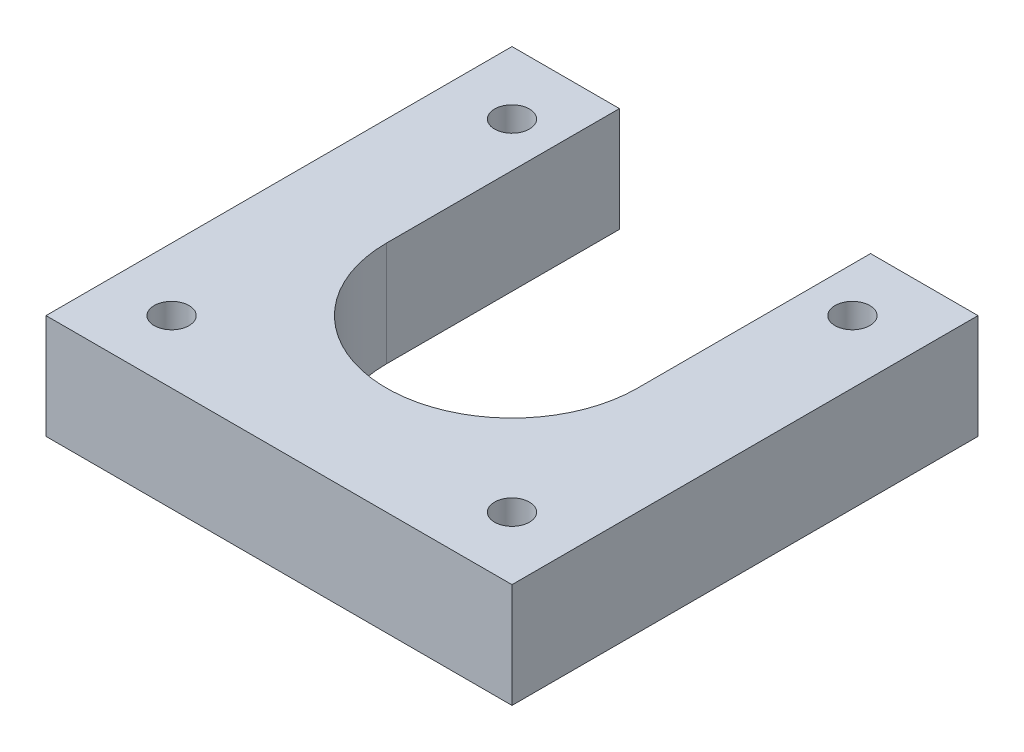
ISO-10303-21;
HEADER;
FILE_DESCRIPTION(('STEP AP214'),'2;1');
FILE_NAME('part.step','',(''),(''),'','','');
FILE_SCHEMA(('AUTOMOTIVE_DESIGN { 1 0 10303 214 1 1 1 1 }'));
ENDSEC;
DATA;
#1=APPLICATION_CONTEXT('core data for automotive mechanical design processes');
#2=APPLICATION_PROTOCOL_DEFINITION('international standard','automotive_design',2000,#1);
#3=PRODUCT_CONTEXT('',#1,'mechanical');
#4=PRODUCT('Part','Part','',(#3));
#5=PRODUCT_RELATED_PRODUCT_CATEGORY('part','',(#4));
#6=PRODUCT_DEFINITION_FORMATION('','',#4);
#7=PRODUCT_DEFINITION_CONTEXT('part definition',#1,'design');
#8=PRODUCT_DEFINITION('design','',#6,#7);
#9=PRODUCT_DEFINITION_SHAPE('','',#8);
#10=(LENGTH_UNIT() NAMED_UNIT(*) SI_UNIT(.MILLI.,.METRE.));
#11=(NAMED_UNIT(*) PLANE_ANGLE_UNIT() SI_UNIT($,.RADIAN.));
#12=(NAMED_UNIT(*) SI_UNIT($,.STERADIAN.) SOLID_ANGLE_UNIT());
#13=UNCERTAINTY_MEASURE_WITH_UNIT(LENGTH_MEASURE(1.E-05),#10,'distance_accuracy_value','');
#14=(GEOMETRIC_REPRESENTATION_CONTEXT(3) GLOBAL_UNCERTAINTY_ASSIGNED_CONTEXT((#13)) GLOBAL_UNIT_ASSIGNED_CONTEXT((#10,
#11,#12)) REPRESENTATION_CONTEXT('',''));
#15=CARTESIAN_POINT('',(0.,0.,0.));
#16=DIRECTION('',(0.,0.,1.));
#17=DIRECTION('',(1.,0.,0.));
#18=AXIS2_PLACEMENT_3D('',#15,#16,#17);
#19=CARTESIAN_POINT('',(21.209,9.525,-21.209));
#20=DIRECTION('',(0.,1.,0.));
#21=DIRECTION('',(0.,0.,1.));
#22=AXIS2_PLACEMENT_3D('',#19,#20,#21);
#23=PLANE('',#22);
#24=CARTESIAN_POINT('',(36.703,9.525,-5.715));
#25=DIRECTION('',(0.,1.,0.));
#26=DIRECTION('',(0.,0.,1.));
#27=AXIS2_PLACEMENT_3D('',#24,#25,#26);
#28=CIRCLE('',#27,1.5875);
#29=CARTESIAN_POINT('',(36.703,9.525,-4.1275));
#30=VERTEX_POINT('',#29);
#31=EDGE_CURVE('E188',#30,#30,#28,.T.);
#32=ORIENTED_EDGE('',*,*,#31,.F.);
#33=EDGE_LOOP('',(#32));
#34=FACE_BOUND('',#33,.T.);
#35=CARTESIAN_POINT('',(5.715,9.525,-36.703));
#36=DIRECTION('',(0.,1.,0.));
#37=DIRECTION('',(0.,0.,1.));
#38=AXIS2_PLACEMENT_3D('',#35,#36,#37);
#39=CIRCLE('',#38,1.5875);
#40=CARTESIAN_POINT('',(5.715,9.525,-35.1155));
#41=VERTEX_POINT('',#40);
#42=EDGE_CURVE('E134',#41,#41,#39,.T.);
#43=ORIENTED_EDGE('',*,*,#42,.F.);
#44=EDGE_LOOP('',(#43));
#45=FACE_BOUND('',#44,.T.);
#46=DIRECTION('',(0.,0.,1.));
#47=VECTOR('',#46,1.);
#48=CARTESIAN_POINT('',(0.,9.525,0.));
#49=LINE('',#48,#47);
#50=CARTESIAN_POINT('',(0.,9.525,-42.418));
#51=VERTEX_POINT('',#50);
#52=CARTESIAN_POINT('',(0.,9.525,0.));
#53=VERTEX_POINT('',#52);
#54=EDGE_CURVE('E145',#51,#53,#49,.T.);
#55=ORIENTED_EDGE('',*,*,#54,.T.);
#56=DIRECTION('',(1.,0.,0.));
#57=VECTOR('',#56,1.);
#58=CARTESIAN_POINT('',(0.,9.525,0.));
#59=LINE('',#58,#57);
#60=CARTESIAN_POINT('',(42.418,9.525,0.));
#61=VERTEX_POINT('',#60);
#62=EDGE_CURVE('E93',#53,#61,#59,.T.);
#63=ORIENTED_EDGE('',*,*,#62,.T.);
#64=DIRECTION('',(0.,0.,-1.));
#65=VECTOR('',#64,1.);
#66=CARTESIAN_POINT('',(42.418,9.525,0.));
#67=LINE('',#66,#65);
#68=CARTESIAN_POINT('',(42.418,9.525,-42.418));
#69=VERTEX_POINT('',#68);
#70=EDGE_CURVE('E160',#61,#69,#67,.T.);
#71=ORIENTED_EDGE('',*,*,#70,.T.);
#72=DIRECTION('',(-1.,0.,0.));
#73=VECTOR('',#72,1.);
#74=CARTESIAN_POINT('',(32.639,9.525,-42.418));
#75=LINE('',#74,#73);
#76=CARTESIAN_POINT('',(32.639,9.525,-42.418));
#77=VERTEX_POINT('',#76);
#78=EDGE_CURVE('E173',#69,#77,#75,.T.);
#79=ORIENTED_EDGE('',*,*,#78,.T.);
#80=DIRECTION('',(0.,0.,1.));
#81=VECTOR('',#80,1.);
#82=CARTESIAN_POINT('',(32.639,9.525,-21.209));
#83=LINE('',#82,#81);
#84=CARTESIAN_POINT('',(32.639,9.525,-21.209));
#85=VERTEX_POINT('',#84);
#86=EDGE_CURVE('E112',#77,#85,#83,.T.);
#87=ORIENTED_EDGE('',*,*,#86,.T.);
#88=CARTESIAN_POINT('',(21.209,9.525,-21.209));
#89=DIRECTION('',(0.,-1.,0.));
#90=DIRECTION('',(0.,0.,1.));
#91=AXIS2_PLACEMENT_3D('',#88,#89,#90);
#92=CIRCLE('',#91,11.43);
#93=CARTESIAN_POINT('',(9.779,9.525,-21.209));
#94=VERTEX_POINT('',#93);
#95=EDGE_CURVE('E106',#85,#94,#92,.T.);
#96=ORIENTED_EDGE('',*,*,#95,.T.);
#97=DIRECTION('',(0.,0.,-1.));
#98=VECTOR('',#97,1.);
#99=CARTESIAN_POINT('',(9.779,9.525,-21.209));
#100=LINE('',#99,#98);
#101=CARTESIAN_POINT('',(9.779,9.525,-42.418));
#102=VERTEX_POINT('',#101);
#103=EDGE_CURVE('E110',#94,#102,#100,.T.);
#104=ORIENTED_EDGE('',*,*,#103,.T.);
#105=DIRECTION('',(-1.,0.,0.));
#106=VECTOR('',#105,1.);
#107=CARTESIAN_POINT('',(9.779,9.525,-42.418));
#108=LINE('',#107,#106);
#109=EDGE_CURVE('E50',#102,#51,#108,.T.);
#110=ORIENTED_EDGE('',*,*,#109,.T.);
#111=EDGE_LOOP('',(#55,#63,#71,#79,#87,#96,#104,#110));
#112=FACE_BOUND('',#111,.T.);
#113=CARTESIAN_POINT('',(36.703,9.525,-36.703));
#114=DIRECTION('',(0.,1.,0.));
#115=DIRECTION('',(0.,0.,1.));
#116=AXIS2_PLACEMENT_3D('',#113,#114,#115);
#117=CIRCLE('',#116,1.5875);
#118=CARTESIAN_POINT('',(36.703,9.525,-35.1155));
#119=VERTEX_POINT('',#118);
#120=EDGE_CURVE('E182',#119,#119,#117,.T.);
#121=ORIENTED_EDGE('',*,*,#120,.F.);
#122=EDGE_LOOP('',(#121));
#123=FACE_BOUND('',#122,.T.);
#124=CARTESIAN_POINT('',(5.715,9.525,-5.715));
#125=DIRECTION('',(0.,1.,0.));
#126=DIRECTION('',(0.,0.,1.));
#127=AXIS2_PLACEMENT_3D('',#124,#125,#126);
#128=CIRCLE('',#127,1.5875);
#129=CARTESIAN_POINT('',(5.715,9.525,-4.1275));
#130=VERTEX_POINT('',#129);
#131=EDGE_CURVE('E194',#130,#130,#128,.T.);
#132=ORIENTED_EDGE('',*,*,#131,.F.);
#133=EDGE_LOOP('',(#132));
#134=FACE_BOUND('',#133,.T.);
#135=ADVANCED_FACE('F33',(#34,#45,#112,#123,#134),#23,.T.);
#136=CARTESIAN_POINT('',(21.209,0.,-21.209));
#137=DIRECTION('',(0.,1.,0.));
#138=DIRECTION('',(0.,0.,1.));
#139=AXIS2_PLACEMENT_3D('',#136,#137,#138);
#140=PLANE('',#139);
#141=DIRECTION('',(0.,0.,1.));
#142=VECTOR('',#141,1.);
#143=CARTESIAN_POINT('',(0.,0.,0.));
#144=LINE('',#143,#142);
#145=CARTESIAN_POINT('',(0.,0.,-42.418));
#146=VERTEX_POINT('',#145);
#147=CARTESIAN_POINT('',(0.,0.,0.));
#148=VERTEX_POINT('',#147);
#149=EDGE_CURVE('E130',#146,#148,#144,.T.);
#150=ORIENTED_EDGE('',*,*,#149,.F.);
#151=DIRECTION('',(-1.,0.,0.));
#152=VECTOR('',#151,1.);
#153=CARTESIAN_POINT('',(9.779,0.,-42.418));
#154=LINE('',#153,#152);
#155=CARTESIAN_POINT('',(9.779,0.,-42.418));
#156=VERTEX_POINT('',#155);
#157=EDGE_CURVE('E85',#156,#146,#154,.T.);
#158=ORIENTED_EDGE('',*,*,#157,.F.);
#159=DIRECTION('',(0.,0.,-1.));
#160=VECTOR('',#159,1.);
#161=CARTESIAN_POINT('',(9.779,0.,-21.209));
#162=LINE('',#161,#160);
#163=CARTESIAN_POINT('',(9.779,0.,-21.209));
#164=VERTEX_POINT('',#163);
#165=EDGE_CURVE('E79',#164,#156,#162,.T.);
#166=ORIENTED_EDGE('',*,*,#165,.F.);
#167=CARTESIAN_POINT('',(21.209,0.,-21.209));
#168=DIRECTION('',(0.,-1.,0.));
#169=DIRECTION('',(0.,0.,1.));
#170=AXIS2_PLACEMENT_3D('',#167,#168,#169);
#171=CIRCLE('',#170,11.43);
#172=CARTESIAN_POINT('',(32.639,0.,-21.209));
#173=VERTEX_POINT('',#172);
#174=EDGE_CURVE('E120',#173,#164,#171,.T.);
#175=ORIENTED_EDGE('',*,*,#174,.F.);
#176=DIRECTION('',(0.,0.,1.));
#177=VECTOR('',#176,1.);
#178=CARTESIAN_POINT('',(32.639,0.,-21.209));
#179=LINE('',#178,#177);
#180=CARTESIAN_POINT('',(32.639,0.,-42.418));
#181=VERTEX_POINT('',#180);
#182=EDGE_CURVE('E140',#181,#173,#179,.T.);
#183=ORIENTED_EDGE('',*,*,#182,.F.);
#184=DIRECTION('',(-1.,0.,0.));
#185=VECTOR('',#184,1.);
#186=CARTESIAN_POINT('',(32.639,0.,-42.418));
#187=LINE('',#186,#185);
#188=CARTESIAN_POINT('',(42.418,0.,-42.418));
#189=VERTEX_POINT('',#188);
#190=EDGE_CURVE('E138',#189,#181,#187,.T.);
#191=ORIENTED_EDGE('',*,*,#190,.F.);
#192=DIRECTION('',(0.,0.,-1.));
#193=VECTOR('',#192,1.);
#194=CARTESIAN_POINT('',(42.418,0.,0.));
#195=LINE('',#194,#193);
#196=CARTESIAN_POINT('',(42.418,0.,0.));
#197=VERTEX_POINT('',#196);
#198=EDGE_CURVE('E136',#197,#189,#195,.T.);
#199=ORIENTED_EDGE('',*,*,#198,.F.);
#200=DIRECTION('',(1.,0.,0.));
#201=VECTOR('',#200,1.);
#202=CARTESIAN_POINT('',(0.,0.,0.));
#203=LINE('',#202,#201);
#204=EDGE_CURVE('E133',#148,#197,#203,.T.);
#205=ORIENTED_EDGE('',*,*,#204,.F.);
#206=EDGE_LOOP('',(#150,#158,#166,#175,#183,#191,#199,#205));
#207=FACE_BOUND('',#206,.T.);
#208=CARTESIAN_POINT('',(5.715,0.,-36.703));
#209=DIRECTION('',(0.,1.,0.));
#210=DIRECTION('',(0.,0.,1.));
#211=AXIS2_PLACEMENT_3D('',#208,#209,#210);
#212=CIRCLE('',#211,1.5875);
#213=CARTESIAN_POINT('',(5.715,0.,-35.1155));
#214=VERTEX_POINT('',#213);
#215=EDGE_CURVE('E179',#214,#214,#212,.T.);
#216=ORIENTED_EDGE('',*,*,#215,.T.);
#217=EDGE_LOOP('',(#216));
#218=FACE_BOUND('',#217,.T.);
#219=CARTESIAN_POINT('',(36.703,0.,-36.703));
#220=DIRECTION('',(0.,1.,0.));
#221=DIRECTION('',(0.,0.,1.));
#222=AXIS2_PLACEMENT_3D('',#219,#220,#221);
#223=CIRCLE('',#222,1.5875);
#224=CARTESIAN_POINT('',(36.703,0.,-35.1155));
#225=VERTEX_POINT('',#224);
#226=EDGE_CURVE('E185',#225,#225,#223,.T.);
#227=ORIENTED_EDGE('',*,*,#226,.T.);
#228=EDGE_LOOP('',(#227));
#229=FACE_BOUND('',#228,.T.);
#230=CARTESIAN_POINT('',(36.703,0.,-5.715));
#231=DIRECTION('',(0.,1.,0.));
#232=DIRECTION('',(0.,0.,1.));
#233=AXIS2_PLACEMENT_3D('',#230,#231,#232);
#234=CIRCLE('',#233,1.5875);
#235=CARTESIAN_POINT('',(36.703,0.,-4.1275));
#236=VERTEX_POINT('',#235);
#237=EDGE_CURVE('E191',#236,#236,#234,.T.);
#238=ORIENTED_EDGE('',*,*,#237,.T.);
#239=EDGE_LOOP('',(#238));
#240=FACE_BOUND('',#239,.T.);
#241=CARTESIAN_POINT('',(5.715,0.,-5.715));
#242=DIRECTION('',(0.,1.,0.));
#243=DIRECTION('',(0.,0.,1.));
#244=AXIS2_PLACEMENT_3D('',#241,#242,#243);
#245=CIRCLE('',#244,1.5875);
#246=CARTESIAN_POINT('',(5.715,0.,-4.1275));
#247=VERTEX_POINT('',#246);
#248=EDGE_CURVE('E197',#247,#247,#245,.T.);
#249=ORIENTED_EDGE('',*,*,#248,.T.);
#250=EDGE_LOOP('',(#249));
#251=FACE_BOUND('',#250,.T.);
#252=ADVANCED_FACE('F164',(#207,#218,#229,#240,#251),#140,.F.);
#253=CARTESIAN_POINT('',(0.,9.525,0.));
#254=DIRECTION('',(1.,0.,0.));
#255=DIRECTION('',(0.,0.,-1.));
#256=AXIS2_PLACEMENT_3D('',#253,#254,#255);
#257=PLANE('',#256);
#258=ORIENTED_EDGE('',*,*,#149,.T.);
#259=DIRECTION('',(0.,-1.,0.));
#260=VECTOR('',#259,1.);
#261=CARTESIAN_POINT('',(0.,9.525,0.));
#262=LINE('',#261,#260);
#263=EDGE_CURVE('E11',#53,#148,#262,.T.);
#264=ORIENTED_EDGE('',*,*,#263,.F.);
#265=ORIENTED_EDGE('',*,*,#54,.F.);
#266=DIRECTION('',(0.,-1.,0.));
#267=VECTOR('',#266,1.);
#268=CARTESIAN_POINT('',(0.,9.525,-42.418));
#269=LINE('',#268,#267);
#270=EDGE_CURVE('E126',#51,#146,#269,.T.);
#271=ORIENTED_EDGE('',*,*,#270,.T.);
#272=EDGE_LOOP('',(#258,#264,#265,#271));
#273=FACE_BOUND('',#272,.T.);
#274=ADVANCED_FACE('F35',(#273),#257,.F.);
#275=CARTESIAN_POINT('',(0.,9.525,0.));
#276=DIRECTION('',(0.,0.,-1.));
#277=DIRECTION('',(-1.,0.,0.));
#278=AXIS2_PLACEMENT_3D('',#275,#276,#277);
#279=PLANE('',#278);
#280=ORIENTED_EDGE('',*,*,#204,.T.);
#281=DIRECTION('',(0.,-1.,0.));
#282=VECTOR('',#281,1.);
#283=CARTESIAN_POINT('',(42.418,9.525,0.));
#284=LINE('',#283,#282);
#285=EDGE_CURVE('E42',#61,#197,#284,.T.);
#286=ORIENTED_EDGE('',*,*,#285,.F.);
#287=ORIENTED_EDGE('',*,*,#62,.F.);
#288=ORIENTED_EDGE('',*,*,#263,.T.);
#289=EDGE_LOOP('',(#280,#286,#287,#288));
#290=FACE_BOUND('',#289,.T.);
#291=ADVANCED_FACE('F231',(#290),#279,.F.);
#292=CARTESIAN_POINT('',(42.418,9.525,0.));
#293=DIRECTION('',(-1.,0.,0.));
#294=DIRECTION('',(0.,0.,1.));
#295=AXIS2_PLACEMENT_3D('',#292,#293,#294);
#296=PLANE('',#295);
#297=ORIENTED_EDGE('',*,*,#198,.T.);
#298=DIRECTION('',(0.,-1.,0.));
#299=VECTOR('',#298,1.);
#300=CARTESIAN_POINT('',(42.418,9.525,-42.418));
#301=LINE('',#300,#299);
#302=EDGE_CURVE('E152',#69,#189,#301,.T.);
#303=ORIENTED_EDGE('',*,*,#302,.F.);
#304=ORIENTED_EDGE('',*,*,#70,.F.);
#305=ORIENTED_EDGE('',*,*,#285,.T.);
#306=EDGE_LOOP('',(#297,#303,#304,#305));
#307=FACE_BOUND('',#306,.T.);
#308=ADVANCED_FACE('F158',(#307),#296,.F.);
#309=CARTESIAN_POINT('',(32.639,9.525,-42.418));
#310=DIRECTION('',(0.,0.,1.));
#311=DIRECTION('',(1.,0.,0.));
#312=AXIS2_PLACEMENT_3D('',#309,#310,#311);
#313=PLANE('',#312);
#314=ORIENTED_EDGE('',*,*,#190,.T.);
#315=DIRECTION('',(0.,-1.,0.));
#316=VECTOR('',#315,1.);
#317=CARTESIAN_POINT('',(32.639,9.525,-42.418));
#318=LINE('',#317,#316);
#319=EDGE_CURVE('E149',#77,#181,#318,.T.);
#320=ORIENTED_EDGE('',*,*,#319,.F.);
#321=ORIENTED_EDGE('',*,*,#78,.F.);
#322=ORIENTED_EDGE('',*,*,#302,.T.);
#323=EDGE_LOOP('',(#314,#320,#321,#322));
#324=FACE_BOUND('',#323,.T.);
#325=ADVANCED_FACE('F169',(#324),#313,.F.);
#326=CARTESIAN_POINT('',(32.639,9.525,-21.209));
#327=DIRECTION('',(1.,0.,0.));
#328=DIRECTION('',(0.,0.,-1.));
#329=AXIS2_PLACEMENT_3D('',#326,#327,#328);
#330=PLANE('',#329);
#331=ORIENTED_EDGE('',*,*,#182,.T.);
#332=DIRECTION('',(0.,-1.,0.));
#333=VECTOR('',#332,1.);
#334=CARTESIAN_POINT('',(32.639,9.525,-21.209));
#335=LINE('',#334,#333);
#336=EDGE_CURVE('E121',#85,#173,#335,.T.);
#337=ORIENTED_EDGE('',*,*,#336,.F.);
#338=ORIENTED_EDGE('',*,*,#86,.F.);
#339=ORIENTED_EDGE('',*,*,#319,.T.);
#340=EDGE_LOOP('',(#331,#337,#338,#339));
#341=FACE_BOUND('',#340,.T.);
#342=ADVANCED_FACE('F172',(#341),#330,.F.);
#343=CARTESIAN_POINT('',(21.209,9.525,-21.209));
#344=DIRECTION('',(0.,-1.,0.));
#345=DIRECTION('',(0.,0.,-1.));
#346=AXIS2_PLACEMENT_3D('',#343,#344,#345);
#347=CYLINDRICAL_SURFACE('',#346,11.43);
#348=ORIENTED_EDGE('',*,*,#174,.T.);
#349=DIRECTION('',(0.,-1.,0.));
#350=VECTOR('',#349,1.);
#351=CARTESIAN_POINT('',(9.779,9.525,-21.209));
#352=LINE('',#351,#350);
#353=EDGE_CURVE('E117',#94,#164,#352,.T.);
#354=ORIENTED_EDGE('',*,*,#353,.F.);
#355=ORIENTED_EDGE('',*,*,#95,.F.);
#356=ORIENTED_EDGE('',*,*,#336,.T.);
#357=EDGE_LOOP('',(#348,#354,#355,#356));
#358=FACE_BOUND('',#357,.T.);
#359=ADVANCED_FACE('F118',(#358),#347,.F.);
#360=CARTESIAN_POINT('',(9.779,9.525,-21.209));
#361=DIRECTION('',(-1.,0.,0.));
#362=DIRECTION('',(0.,0.,1.));
#363=AXIS2_PLACEMENT_3D('',#360,#361,#362);
#364=PLANE('',#363);
#365=ORIENTED_EDGE('',*,*,#165,.T.);
#366=DIRECTION('',(0.,-1.,0.));
#367=VECTOR('',#366,1.);
#368=CARTESIAN_POINT('',(9.779,9.525,-42.418));
#369=LINE('',#368,#367);
#370=EDGE_CURVE('E122',#102,#156,#369,.T.);
#371=ORIENTED_EDGE('',*,*,#370,.F.);
#372=ORIENTED_EDGE('',*,*,#103,.F.);
#373=ORIENTED_EDGE('',*,*,#353,.T.);
#374=EDGE_LOOP('',(#365,#371,#372,#373));
#375=FACE_BOUND('',#374,.T.);
#376=ADVANCED_FACE('F124',(#375),#364,.F.);
#377=CARTESIAN_POINT('',(9.779,9.525,-42.418));
#378=DIRECTION('',(0.,0.,1.));
#379=DIRECTION('',(1.,0.,0.));
#380=AXIS2_PLACEMENT_3D('',#377,#378,#379);
#381=PLANE('',#380);
#382=ORIENTED_EDGE('',*,*,#157,.T.);
#383=ORIENTED_EDGE('',*,*,#270,.F.);
#384=ORIENTED_EDGE('',*,*,#109,.F.);
#385=ORIENTED_EDGE('',*,*,#370,.T.);
#386=EDGE_LOOP('',(#382,#383,#384,#385));
#387=FACE_BOUND('',#386,.T.);
#388=ADVANCED_FACE('F219',(#387),#381,.F.);
#389=CARTESIAN_POINT('',(5.715,9.525,-36.703));
#390=DIRECTION('',(0.,-1.,0.));
#391=DIRECTION('',(0.,0.,-1.));
#392=AXIS2_PLACEMENT_3D('',#389,#390,#391);
#393=CYLINDRICAL_SURFACE('',#392,1.5875);
#394=ORIENTED_EDGE('',*,*,#42,.T.);
#395=EDGE_LOOP('',(#394));
#396=FACE_BOUND('',#395,.T.);
#397=ORIENTED_EDGE('',*,*,#215,.F.);
#398=EDGE_LOOP('',(#397));
#399=FACE_BOUND('',#398,.T.);
#400=ADVANCED_FACE('F216',(#396,#399),#393,.F.);
#401=CARTESIAN_POINT('',(36.703,9.525,-36.703));
#402=DIRECTION('',(0.,-1.,0.));
#403=DIRECTION('',(0.,0.,-1.));
#404=AXIS2_PLACEMENT_3D('',#401,#402,#403);
#405=CYLINDRICAL_SURFACE('',#404,1.5875);
#406=ORIENTED_EDGE('',*,*,#120,.T.);
#407=EDGE_LOOP('',(#406));
#408=FACE_BOUND('',#407,.T.);
#409=ORIENTED_EDGE('',*,*,#226,.F.);
#410=EDGE_LOOP('',(#409));
#411=FACE_BOUND('',#410,.T.);
#412=ADVANCED_FACE('F295',(#408,#411),#405,.F.);
#413=CARTESIAN_POINT('',(36.703,9.525,-5.715));
#414=DIRECTION('',(0.,-1.,0.));
#415=DIRECTION('',(0.,0.,-1.));
#416=AXIS2_PLACEMENT_3D('',#413,#414,#415);
#417=CYLINDRICAL_SURFACE('',#416,1.5875);
#418=ORIENTED_EDGE('',*,*,#31,.T.);
#419=EDGE_LOOP('',(#418));
#420=FACE_BOUND('',#419,.T.);
#421=ORIENTED_EDGE('',*,*,#237,.F.);
#422=EDGE_LOOP('',(#421));
#423=FACE_BOUND('',#422,.T.);
#424=ADVANCED_FACE('F303',(#420,#423),#417,.F.);
#425=CARTESIAN_POINT('',(5.715,9.525,-5.715));
#426=DIRECTION('',(0.,-1.,0.));
#427=DIRECTION('',(0.,0.,-1.));
#428=AXIS2_PLACEMENT_3D('',#425,#426,#427);
#429=CYLINDRICAL_SURFACE('',#428,1.5875);
#430=ORIENTED_EDGE('',*,*,#131,.T.);
#431=EDGE_LOOP('',(#430));
#432=FACE_BOUND('',#431,.T.);
#433=ORIENTED_EDGE('',*,*,#248,.F.);
#434=EDGE_LOOP('',(#433));
#435=FACE_BOUND('',#434,.T.);
#436=ADVANCED_FACE('F203',(#432,#435),#429,.F.);
#437=CLOSED_SHELL('',(#135,#252,#274,#291,#308,#325,#342,#359,#376,#388,#400,#412,#424,#436));
#438=MANIFOLD_SOLID_BREP('B2',#437);
#439=ADVANCED_BREP_SHAPE_REPRESENTATION('',(#18,#438),#14);
#440=SHAPE_DEFINITION_REPRESENTATION(#9,#439);
ENDSEC;
END-ISO-10303-21;
